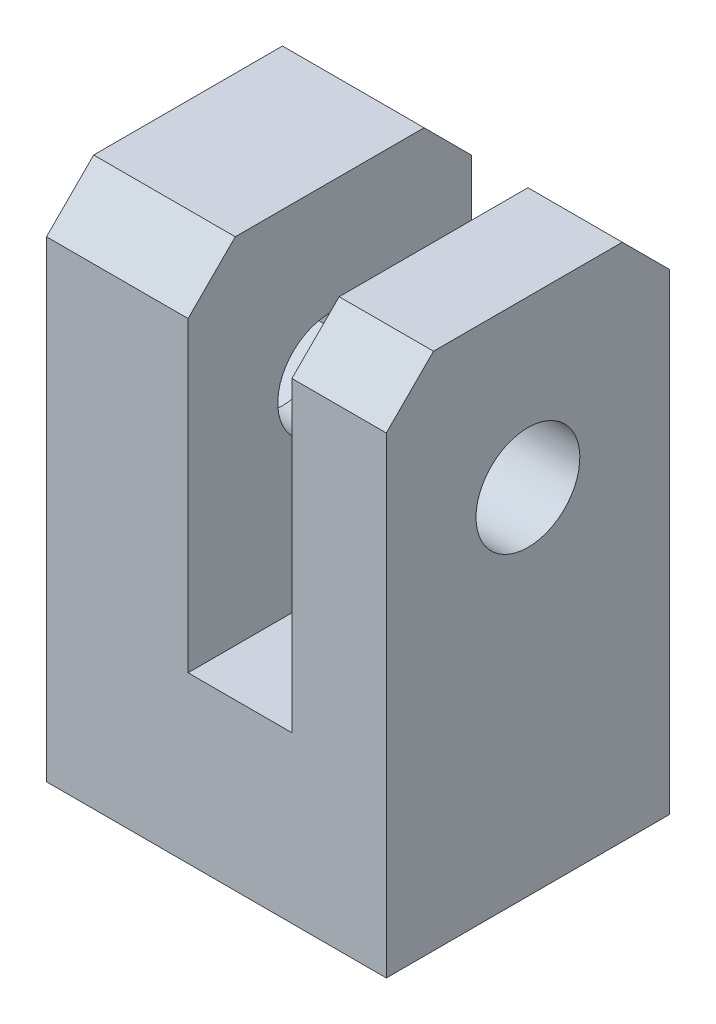
ISO-10303-21;
HEADER;
FILE_DESCRIPTION(('STEP AP214'),'2;1');
FILE_NAME('part.step','',(''),(''),'','','');
FILE_SCHEMA(('AUTOMOTIVE_DESIGN { 1 0 10303 214 1 1 1 1 }'));
ENDSEC;
DATA;
#1=APPLICATION_CONTEXT('core data for automotive mechanical design processes');
#2=APPLICATION_PROTOCOL_DEFINITION('international standard','automotive_design',2000,#1);
#3=PRODUCT_CONTEXT('',#1,'mechanical');
#4=PRODUCT('Part','Part','',(#3));
#5=PRODUCT_RELATED_PRODUCT_CATEGORY('part','',(#4));
#6=PRODUCT_DEFINITION_FORMATION('','',#4);
#7=PRODUCT_DEFINITION_CONTEXT('part definition',#1,'design');
#8=PRODUCT_DEFINITION('design','',#6,#7);
#9=PRODUCT_DEFINITION_SHAPE('','',#8);
#10=(LENGTH_UNIT() NAMED_UNIT(*) SI_UNIT(.MILLI.,.METRE.));
#11=(NAMED_UNIT(*) PLANE_ANGLE_UNIT() SI_UNIT($,.RADIAN.));
#12=(NAMED_UNIT(*) SI_UNIT($,.STERADIAN.) SOLID_ANGLE_UNIT());
#13=UNCERTAINTY_MEASURE_WITH_UNIT(LENGTH_MEASURE(1.E-05),#10,'distance_accuracy_value','');
#14=(GEOMETRIC_REPRESENTATION_CONTEXT(3) GLOBAL_UNCERTAINTY_ASSIGNED_CONTEXT((#13)) GLOBAL_UNIT_ASSIGNED_CONTEXT((#10,
#11,#12)) REPRESENTATION_CONTEXT('',''));
#15=CARTESIAN_POINT('',(0.,0.,0.));
#16=DIRECTION('',(0.,0.,1.));
#17=DIRECTION('',(1.,0.,0.));
#18=AXIS2_PLACEMENT_3D('',#15,#16,#17);
#19=CARTESIAN_POINT('',(1.1,7.5,6.));
#20=DIRECTION('',(0.,-1.,0.));
#21=DIRECTION('',(0.,0.,-1.));
#22=AXIS2_PLACEMENT_3D('',#19,#20,#21);
#23=PLANE('',#22);
#24=DIRECTION('',(0.,0.,-1.));
#25=VECTOR('',#24,1.);
#26=CARTESIAN_POINT('',(3.1,7.5,6.));
#27=LINE('',#26,#25);
#28=CARTESIAN_POINT('',(3.1,7.5,5.));
#29=VERTEX_POINT('',#28);
#30=CARTESIAN_POINT('',(3.1,7.5,0.999999999999999));
#31=VERTEX_POINT('',#30);
#32=EDGE_CURVE('E254',#29,#31,#27,.T.);
#33=ORIENTED_EDGE('',*,*,#32,.T.);
#34=DIRECTION('',(-1.,0.,0.));
#35=VECTOR('',#34,1.);
#36=CARTESIAN_POINT('',(1.1,7.5,0.999999999999999));
#37=LINE('',#36,#35);
#38=CARTESIAN_POINT('',(1.1,7.5,0.999999999999999));
#39=VERTEX_POINT('',#38);
#40=EDGE_CURVE('E301',#31,#39,#37,.T.);
#41=ORIENTED_EDGE('',*,*,#40,.T.);
#42=DIRECTION('',(0.,0.,-1.));
#43=VECTOR('',#42,1.);
#44=CARTESIAN_POINT('',(1.1,7.5,6.));
#45=LINE('',#44,#43);
#46=CARTESIAN_POINT('',(1.1,7.5,5.));
#47=VERTEX_POINT('',#46);
#48=EDGE_CURVE('E279',#47,#39,#45,.T.);
#49=ORIENTED_EDGE('',*,*,#48,.F.);
#50=DIRECTION('',(1.,0.,0.));
#51=VECTOR('',#50,1.);
#52=CARTESIAN_POINT('',(3.1,7.5,5.));
#53=LINE('',#52,#51);
#54=EDGE_CURVE('E299',#47,#29,#53,.T.);
#55=ORIENTED_EDGE('',*,*,#54,.T.);
#56=EDGE_LOOP('',(#33,#41,#49,#55));
#57=FACE_BOUND('',#56,.T.);
#58=ADVANCED_FACE('F32',(#57),#23,.F.);
#59=CARTESIAN_POINT('',(1.1,0.,6.));
#60=DIRECTION('',(1.,0.,0.));
#61=DIRECTION('',(0.,1.,0.));
#62=AXIS2_PLACEMENT_3D('',#59,#60,#61);
#63=PLANE('',#62);
#64=CARTESIAN_POINT('',(1.1,4.,3.));
#65=DIRECTION('',(-1.,0.,0.));
#66=DIRECTION('',(0.,-1.,0.));
#67=AXIS2_PLACEMENT_3D('',#64,#65,#66);
#68=CIRCLE('',#67,1.1);
#69=CARTESIAN_POINT('',(1.1,2.9,3.));
#70=VERTEX_POINT('',#69);
#71=EDGE_CURVE('E235',#70,#70,#68,.T.);
#72=ORIENTED_EDGE('',*,*,#71,.F.);
#73=EDGE_LOOP('',(#72));
#74=FACE_BOUND('',#73,.T.);
#75=ORIENTED_EDGE('',*,*,#48,.T.);
#76=DIRECTION('',(0.,0.707106781186549,0.707106781186546));
#77=VECTOR('',#76,1.);
#78=CARTESIAN_POINT('',(1.1,7.5,0.999999999999999));
#79=LINE('',#78,#77);
#80=CARTESIAN_POINT('',(1.1,6.5,0.));
#81=VERTEX_POINT('',#80);
#82=EDGE_CURVE('E305',#39,#81,#79,.F.);
#83=ORIENTED_EDGE('',*,*,#82,.T.);
#84=DIRECTION('',(0.,-1.,0.));
#85=VECTOR('',#84,1.);
#86=CARTESIAN_POINT('',(1.1,0.,0.));
#87=LINE('',#86,#85);
#88=CARTESIAN_POINT('',(1.1,0.,0.));
#89=VERTEX_POINT('',#88);
#90=EDGE_CURVE('E241',#81,#89,#87,.T.);
#91=ORIENTED_EDGE('',*,*,#90,.T.);
#92=DIRECTION('',(0.,0.,-1.));
#93=VECTOR('',#92,1.);
#94=CARTESIAN_POINT('',(1.1,0.,6.));
#95=LINE('',#94,#93);
#96=CARTESIAN_POINT('',(1.1,0.,6.));
#97=VERTEX_POINT('',#96);
#98=EDGE_CURVE('E276',#97,#89,#95,.T.);
#99=ORIENTED_EDGE('',*,*,#98,.F.);
#100=DIRECTION('',(0.,-1.,0.));
#101=VECTOR('',#100,1.);
#102=CARTESIAN_POINT('',(1.1,0.,6.));
#103=LINE('',#102,#101);
#104=CARTESIAN_POINT('',(1.1,6.5,6.));
#105=VERTEX_POINT('',#104);
#106=EDGE_CURVE('E242',#105,#97,#103,.T.);
#107=ORIENTED_EDGE('',*,*,#106,.F.);
#108=DIRECTION('',(0.,0.707106781186546,-0.707106781186549));
#109=VECTOR('',#108,1.);
#110=CARTESIAN_POINT('',(1.1,6.5,6.));
#111=LINE('',#110,#109);
#112=EDGE_CURVE('E55',#105,#47,#111,.T.);
#113=ORIENTED_EDGE('',*,*,#112,.T.);
#114=EDGE_LOOP('',(#75,#83,#91,#99,#107,#113));
#115=FACE_BOUND('',#114,.T.);
#116=ADVANCED_FACE('F337',(#74,#115),#63,.F.);
#117=CARTESIAN_POINT('',(-1.1,0.,6.));
#118=DIRECTION('',(0.,-1.,0.));
#119=DIRECTION('',(1.,0.,0.));
#120=AXIS2_PLACEMENT_3D('',#117,#118,#119);
#121=PLANE('',#120);
#122=CARTESIAN_POINT('',(0.,0.,3.));
#123=DIRECTION('',(0.,-1.,0.));
#124=DIRECTION('',(1.,0.,0.));
#125=AXIS2_PLACEMENT_3D('',#122,#123,#124);
#126=CIRCLE('',#125,0.95);
#127=CARTESIAN_POINT('',(0.950000000000001,0.,3.));
#128=VERTEX_POINT('',#127);
#129=EDGE_CURVE('E198',#128,#128,#126,.F.);
#130=ORIENTED_EDGE('',*,*,#129,.F.);
#131=EDGE_LOOP('',(#130));
#132=FACE_BOUND('',#131,.T.);
#133=DIRECTION('',(-1.,0.,0.));
#134=VECTOR('',#133,1.);
#135=CARTESIAN_POINT('',(-1.1,0.,0.));
#136=LINE('',#135,#134);
#137=CARTESIAN_POINT('',(-1.1,0.,0.));
#138=VERTEX_POINT('',#137);
#139=EDGE_CURVE('E256',#89,#138,#136,.T.);
#140=ORIENTED_EDGE('',*,*,#139,.T.);
#141=DIRECTION('',(0.,0.,-1.));
#142=VECTOR('',#141,1.);
#143=CARTESIAN_POINT('',(-1.1,0.,6.));
#144=LINE('',#143,#142);
#145=CARTESIAN_POINT('',(-1.1,0.,6.));
#146=VERTEX_POINT('',#145);
#147=EDGE_CURVE('E273',#146,#138,#144,.T.);
#148=ORIENTED_EDGE('',*,*,#147,.F.);
#149=DIRECTION('',(-1.,0.,0.));
#150=VECTOR('',#149,1.);
#151=CARTESIAN_POINT('',(-1.1,0.,6.));
#152=LINE('',#151,#150);
#153=EDGE_CURVE('E244',#97,#146,#152,.T.);
#154=ORIENTED_EDGE('',*,*,#153,.F.);
#155=ORIENTED_EDGE('',*,*,#98,.T.);
#156=EDGE_LOOP('',(#140,#148,#154,#155));
#157=FACE_BOUND('',#156,.T.);
#158=ADVANCED_FACE('F343',(#132,#157),#121,.F.);
#159=CARTESIAN_POINT('',(-1.1,7.5,6.));
#160=DIRECTION('',(-1.,0.,0.));
#161=DIRECTION('',(0.,-1.,0.));
#162=AXIS2_PLACEMENT_3D('',#159,#160,#161);
#163=PLANE('',#162);
#164=CARTESIAN_POINT('',(-1.1,4.,3.));
#165=DIRECTION('',(1.,0.,0.));
#166=DIRECTION('',(0.,0.,-1.));
#167=AXIS2_PLACEMENT_3D('',#164,#165,#166);
#168=CIRCLE('',#167,1.1);
#169=CARTESIAN_POINT('',(-1.1,4.,1.9));
#170=VERTEX_POINT('',#169);
#171=EDGE_CURVE('E229',#170,#170,#168,.T.);
#172=ORIENTED_EDGE('',*,*,#171,.F.);
#173=EDGE_LOOP('',(#172));
#174=FACE_BOUND('',#173,.T.);
#175=DIRECTION('',(0.,1.,0.));
#176=VECTOR('',#175,1.);
#177=CARTESIAN_POINT('',(-1.1,7.5,0.));
#178=LINE('',#177,#176);
#179=CARTESIAN_POINT('',(-1.1,6.5,0.));
#180=VERTEX_POINT('',#179);
#181=EDGE_CURVE('E258',#138,#180,#178,.T.);
#182=ORIENTED_EDGE('',*,*,#181,.T.);
#183=DIRECTION('',(0.,-0.707106781186549,-0.707106781186546));
#184=VECTOR('',#183,1.);
#185=CARTESIAN_POINT('',(-1.1,7.5,0.999999999999999));
#186=LINE('',#185,#184);
#187=CARTESIAN_POINT('',(-1.1,7.5,0.999999999999999));
#188=VERTEX_POINT('',#187);
#189=EDGE_CURVE('E297',#180,#188,#186,.F.);
#190=ORIENTED_EDGE('',*,*,#189,.T.);
#191=DIRECTION('',(0.,0.,-1.));
#192=VECTOR('',#191,1.);
#193=CARTESIAN_POINT('',(-1.1,7.5,6.));
#194=LINE('',#193,#192);
#195=CARTESIAN_POINT('',(-1.1,7.5,5.));
#196=VERTEX_POINT('',#195);
#197=EDGE_CURVE('E270',#196,#188,#194,.T.);
#198=ORIENTED_EDGE('',*,*,#197,.F.);
#199=DIRECTION('',(0.,-0.707106781186546,0.707106781186549));
#200=VECTOR('',#199,1.);
#201=CARTESIAN_POINT('',(-1.1,6.5,6.));
#202=LINE('',#201,#200);
#203=CARTESIAN_POINT('',(-1.1,6.5,6.));
#204=VERTEX_POINT('',#203);
#205=EDGE_CURVE('E295',#196,#204,#202,.T.);
#206=ORIENTED_EDGE('',*,*,#205,.T.);
#207=DIRECTION('',(0.,1.,0.));
#208=VECTOR('',#207,1.);
#209=CARTESIAN_POINT('',(-1.1,7.5,6.));
#210=LINE('',#209,#208);
#211=EDGE_CURVE('E247',#146,#204,#210,.T.);
#212=ORIENTED_EDGE('',*,*,#211,.F.);
#213=ORIENTED_EDGE('',*,*,#147,.T.);
#214=EDGE_LOOP('',(#182,#190,#198,#206,#212,#213));
#215=FACE_BOUND('',#214,.T.);
#216=ADVANCED_FACE('F347',(#174,#215),#163,.F.);
#217=CARTESIAN_POINT('',(-2.1,7.5,6.));
#218=DIRECTION('',(0.,-1.,0.));
#219=DIRECTION('',(0.,0.,-1.));
#220=AXIS2_PLACEMENT_3D('',#217,#218,#219);
#221=PLANE('',#220);
#222=ORIENTED_EDGE('',*,*,#197,.T.);
#223=DIRECTION('',(-1.,0.,0.));
#224=VECTOR('',#223,1.);
#225=CARTESIAN_POINT('',(-2.1,7.5,0.999999999999999));
#226=LINE('',#225,#224);
#227=CARTESIAN_POINT('',(-4.1,7.5,0.999999999999999));
#228=VERTEX_POINT('',#227);
#229=EDGE_CURVE('E284',#188,#228,#226,.T.);
#230=ORIENTED_EDGE('',*,*,#229,.T.);
#231=DIRECTION('',(0.,0.,-1.));
#232=VECTOR('',#231,1.);
#233=CARTESIAN_POINT('',(-4.1,7.5,6.));
#234=LINE('',#233,#232);
#235=CARTESIAN_POINT('',(-4.1,7.5,5.));
#236=VERTEX_POINT('',#235);
#237=EDGE_CURVE('E178',#236,#228,#234,.T.);
#238=ORIENTED_EDGE('',*,*,#237,.F.);
#239=DIRECTION('',(1.,0.,0.));
#240=VECTOR('',#239,1.);
#241=CARTESIAN_POINT('',(-1.1,7.5,5.));
#242=LINE('',#241,#240);
#243=EDGE_CURVE('E282',#236,#196,#242,.T.);
#244=ORIENTED_EDGE('',*,*,#243,.T.);
#245=EDGE_LOOP('',(#222,#230,#238,#244));
#246=FACE_BOUND('',#245,.T.);
#247=ADVANCED_FACE('F351',(#246),#221,.F.);
#248=CARTESIAN_POINT('',(-2.1,-3.5,6.));
#249=DIRECTION('',(1.,0.,0.));
#250=DIRECTION('',(0.,0.,-1.));
#251=AXIS2_PLACEMENT_3D('',#248,#249,#250);
#252=PLANE('',#251);
#253=DIRECTION('',(0.,-0.5,0.866025403784438));
#254=VECTOR('',#253,1.);
#255=CARTESIAN_POINT('',(-2.1,2.84529946162075,0.999999999999998));
#256=LINE('',#255,#254);
#257=CARTESIAN_POINT('',(-2.1,2.84529946162075,0.999999999999998));
#258=VERTEX_POINT('',#257);
#259=CARTESIAN_POINT('',(-2.1,1.69059892324149,3.));
#260=VERTEX_POINT('',#259);
#261=EDGE_CURVE('E171',#258,#260,#256,.T.);
#262=ORIENTED_EDGE('',*,*,#261,.T.);
#263=DIRECTION('',(0.,0.5,0.866025403784438));
#264=VECTOR('',#263,1.);
#265=CARTESIAN_POINT('',(-2.1,1.69059892324149,3.));
#266=LINE('',#265,#264);
#267=CARTESIAN_POINT('',(-2.1,2.84529946162075,5.));
#268=VERTEX_POINT('',#267);
#269=EDGE_CURVE('E196',#260,#268,#266,.T.);
#270=ORIENTED_EDGE('',*,*,#269,.T.);
#271=DIRECTION('',(0.,1.,0.));
#272=VECTOR('',#271,1.);
#273=CARTESIAN_POINT('',(-2.1,2.84529946162075,5.));
#274=LINE('',#273,#272);
#275=CARTESIAN_POINT('',(-2.1,5.15470053837925,5.));
#276=VERTEX_POINT('',#275);
#277=EDGE_CURVE('E177',#268,#276,#274,.T.);
#278=ORIENTED_EDGE('',*,*,#277,.T.);
#279=DIRECTION('',(0.,0.5,-0.866025403784439));
#280=VECTOR('',#279,1.);
#281=CARTESIAN_POINT('',(-2.1,5.15470053837925,5.));
#282=LINE('',#281,#280);
#283=CARTESIAN_POINT('',(-2.1,6.3094010767585,3.));
#284=VERTEX_POINT('',#283);
#285=EDGE_CURVE('E200',#276,#284,#282,.T.);
#286=ORIENTED_EDGE('',*,*,#285,.T.);
#287=DIRECTION('',(0.,-0.5,-0.866025403784438));
#288=VECTOR('',#287,1.);
#289=CARTESIAN_POINT('',(-2.1,6.3094010767585,3.));
#290=LINE('',#289,#288);
#291=CARTESIAN_POINT('',(-2.1,5.15470053837925,0.999999999999999));
#292=VERTEX_POINT('',#291);
#293=EDGE_CURVE('E203',#284,#292,#290,.T.);
#294=ORIENTED_EDGE('',*,*,#293,.T.);
#295=DIRECTION('',(0.,-1.,0.));
#296=VECTOR('',#295,1.);
#297=CARTESIAN_POINT('',(-2.1,5.15470053837925,0.999999999999999));
#298=LINE('',#297,#296);
#299=EDGE_CURVE('E206',#292,#258,#298,.T.);
#300=ORIENTED_EDGE('',*,*,#299,.T.);
#301=EDGE_LOOP('',(#262,#270,#278,#286,#294,#300));
#302=FACE_BOUND('',#301,.T.);
#303=CARTESIAN_POINT('',(-2.1,4.,3.));
#304=DIRECTION('',(1.,0.,0.));
#305=DIRECTION('',(0.,0.,-1.));
#306=AXIS2_PLACEMENT_3D('',#303,#304,#305);
#307=CIRCLE('',#306,1.1);
#308=CARTESIAN_POINT('',(-2.1,4.,1.9));
#309=VERTEX_POINT('',#308);
#310=EDGE_CURVE('E232',#309,#309,#307,.F.);
#311=ORIENTED_EDGE('',*,*,#310,.F.);
#312=EDGE_LOOP('',(#311));
#313=FACE_BOUND('',#312,.T.);
#314=ADVANCED_FACE('F386',(#302,#313),#252,.F.);
#315=CARTESIAN_POINT('',(-2.1,-3.5,6.));
#316=DIRECTION('',(0.,1.,0.));
#317=DIRECTION('',(0.,0.,1.));
#318=AXIS2_PLACEMENT_3D('',#315,#316,#317);
#319=PLANE('',#318);
#320=CARTESIAN_POINT('',(0.,-3.5,3.));
#321=DIRECTION('',(0.,-1.,0.));
#322=DIRECTION('',(1.,0.,0.));
#323=AXIS2_PLACEMENT_3D('',#320,#321,#322);
#324=CIRCLE('',#323,0.95);
#325=CARTESIAN_POINT('',(0.95,-3.5,3.));
#326=VERTEX_POINT('',#325);
#327=EDGE_CURVE('E598',#326,#326,#324,.T.);
#328=ORIENTED_EDGE('',*,*,#327,.F.);
#329=EDGE_LOOP('',(#328));
#330=FACE_BOUND('',#329,.T.);
#331=DIRECTION('',(1.,0.,0.));
#332=VECTOR('',#331,1.);
#333=CARTESIAN_POINT('',(-2.1,-3.5,0.));
#334=LINE('',#333,#332);
#335=CARTESIAN_POINT('',(-4.1,-3.5,0.));
#336=VERTEX_POINT('',#335);
#337=CARTESIAN_POINT('',(3.1,-3.5,0.));
#338=VERTEX_POINT('',#337);
#339=EDGE_CURVE('E261',#336,#338,#334,.T.);
#340=ORIENTED_EDGE('',*,*,#339,.T.);
#341=DIRECTION('',(0.,0.,-1.));
#342=VECTOR('',#341,1.);
#343=CARTESIAN_POINT('',(3.1,-3.5,6.));
#344=LINE('',#343,#342);
#345=CARTESIAN_POINT('',(3.1,-3.5,6.));
#346=VERTEX_POINT('',#345);
#347=EDGE_CURVE('E267',#346,#338,#344,.T.);
#348=ORIENTED_EDGE('',*,*,#347,.F.);
#349=DIRECTION('',(1.,0.,0.));
#350=VECTOR('',#349,1.);
#351=CARTESIAN_POINT('',(-2.1,-3.5,6.));
#352=LINE('',#351,#350);
#353=CARTESIAN_POINT('',(-4.1,-3.5,6.));
#354=VERTEX_POINT('',#353);
#355=EDGE_CURVE('E250',#354,#346,#352,.T.);
#356=ORIENTED_EDGE('',*,*,#355,.F.);
#357=DIRECTION('',(0.,0.,1.));
#358=VECTOR('',#357,1.);
#359=CARTESIAN_POINT('',(-4.1,-3.5,0.));
#360=LINE('',#359,#358);
#361=EDGE_CURVE('E223',#336,#354,#360,.T.);
#362=ORIENTED_EDGE('',*,*,#361,.F.);
#363=EDGE_LOOP('',(#340,#348,#356,#362));
#364=FACE_BOUND('',#363,.T.);
#365=ADVANCED_FACE('F323',(#330,#364),#319,.F.);
#366=CARTESIAN_POINT('',(3.1,-3.5,6.));
#367=DIRECTION('',(-1.,0.,0.));
#368=DIRECTION('',(0.,0.,1.));
#369=AXIS2_PLACEMENT_3D('',#366,#367,#368);
#370=PLANE('',#369);
#371=CARTESIAN_POINT('',(3.1,4.,3.));
#372=DIRECTION('',(-1.,0.,0.));
#373=DIRECTION('',(0.,0.,1.));
#374=AXIS2_PLACEMENT_3D('',#371,#372,#373);
#375=CIRCLE('',#374,1.1);
#376=CARTESIAN_POINT('',(3.1,4.,4.1));
#377=VERTEX_POINT('',#376);
#378=EDGE_CURVE('E238',#377,#377,#375,.F.);
#379=ORIENTED_EDGE('',*,*,#378,.F.);
#380=EDGE_LOOP('',(#379));
#381=FACE_BOUND('',#380,.T.);
#382=DIRECTION('',(0.,1.,0.));
#383=VECTOR('',#382,1.);
#384=CARTESIAN_POINT('',(3.1,-3.5,0.));
#385=LINE('',#384,#383);
#386=CARTESIAN_POINT('',(3.1,6.5,0.));
#387=VERTEX_POINT('',#386);
#388=EDGE_CURVE('E245',#338,#387,#385,.T.);
#389=ORIENTED_EDGE('',*,*,#388,.T.);
#390=DIRECTION('',(0.,-0.707106781186549,-0.707106781186546));
#391=VECTOR('',#390,1.);
#392=CARTESIAN_POINT('',(3.1,7.5,0.999999999999999));
#393=LINE('',#392,#391);
#394=EDGE_CURVE('E308',#387,#31,#393,.F.);
#395=ORIENTED_EDGE('',*,*,#394,.T.);
#396=ORIENTED_EDGE('',*,*,#32,.F.);
#397=DIRECTION('',(0.,-0.707106781186546,0.707106781186549));
#398=VECTOR('',#397,1.);
#399=CARTESIAN_POINT('',(3.1,6.5,6.));
#400=LINE('',#399,#398);
#401=CARTESIAN_POINT('',(3.1,6.5,6.));
#402=VERTEX_POINT('',#401);
#403=EDGE_CURVE('E47',#29,#402,#400,.T.);
#404=ORIENTED_EDGE('',*,*,#403,.T.);
#405=DIRECTION('',(0.,1.,0.));
#406=VECTOR('',#405,1.);
#407=CARTESIAN_POINT('',(3.1,-3.5,6.));
#408=LINE('',#407,#406);
#409=EDGE_CURVE('E252',#346,#402,#408,.T.);
#410=ORIENTED_EDGE('',*,*,#409,.F.);
#411=ORIENTED_EDGE('',*,*,#347,.T.);
#412=EDGE_LOOP('',(#389,#395,#396,#404,#410,#411));
#413=FACE_BOUND('',#412,.T.);
#414=ADVANCED_FACE('F330',(#381,#413),#370,.F.);
#415=CARTESIAN_POINT('',(0.,0.,6.));
#416=DIRECTION('',(0.,0.,1.));
#417=DIRECTION('',(1.,0.,0.));
#418=AXIS2_PLACEMENT_3D('',#415,#416,#417);
#419=PLANE('',#418);
#420=ORIENTED_EDGE('',*,*,#409,.T.);
#421=DIRECTION('',(-1.,0.,0.));
#422=VECTOR('',#421,1.);
#423=CARTESIAN_POINT('',(1.1,6.5,6.));
#424=LINE('',#423,#422);
#425=EDGE_CURVE('E11',#402,#105,#424,.T.);
#426=ORIENTED_EDGE('',*,*,#425,.T.);
#427=ORIENTED_EDGE('',*,*,#106,.T.);
#428=ORIENTED_EDGE('',*,*,#153,.T.);
#429=ORIENTED_EDGE('',*,*,#211,.T.);
#430=DIRECTION('',(-1.,0.,0.));
#431=VECTOR('',#430,1.);
#432=CARTESIAN_POINT('',(-4.1,6.5,6.));
#433=LINE('',#432,#431);
#434=CARTESIAN_POINT('',(-4.1,6.5,6.));
#435=VERTEX_POINT('',#434);
#436=EDGE_CURVE('E40',#204,#435,#433,.T.);
#437=ORIENTED_EDGE('',*,*,#436,.T.);
#438=DIRECTION('',(0.,1.,0.));
#439=VECTOR('',#438,1.);
#440=CARTESIAN_POINT('',(-4.1,-3.5,6.));
#441=LINE('',#440,#439);
#442=EDGE_CURVE('E226',#354,#435,#441,.T.);
#443=ORIENTED_EDGE('',*,*,#442,.F.);
#444=ORIENTED_EDGE('',*,*,#355,.T.);
#445=EDGE_LOOP('',(#420,#426,#427,#428,#429,#437,#443,#444));
#446=FACE_BOUND('',#445,.T.);
#447=ADVANCED_FACE('F313',(#446),#419,.T.);
#448=CARTESIAN_POINT('',(0.,0.,0.));
#449=DIRECTION('',(0.,0.,1.));
#450=DIRECTION('',(1.,0.,0.));
#451=AXIS2_PLACEMENT_3D('',#448,#449,#450);
#452=PLANE('',#451);
#453=DIRECTION('',(0.,-1.,0.));
#454=VECTOR('',#453,1.);
#455=CARTESIAN_POINT('',(-4.1,7.5,0.));
#456=LINE('',#455,#454);
#457=CARTESIAN_POINT('',(-4.1,6.5,0.));
#458=VERTEX_POINT('',#457);
#459=EDGE_CURVE('E221',#458,#336,#456,.T.);
#460=ORIENTED_EDGE('',*,*,#459,.F.);
#461=DIRECTION('',(1.,0.,0.));
#462=VECTOR('',#461,1.);
#463=CARTESIAN_POINT('',(0.,6.5,0.));
#464=LINE('',#463,#462);
#465=EDGE_CURVE('E293',#458,#180,#464,.T.);
#466=ORIENTED_EDGE('',*,*,#465,.T.);
#467=ORIENTED_EDGE('',*,*,#181,.F.);
#468=ORIENTED_EDGE('',*,*,#139,.F.);
#469=ORIENTED_EDGE('',*,*,#90,.F.);
#470=DIRECTION('',(1.,0.,0.));
#471=VECTOR('',#470,1.);
#472=CARTESIAN_POINT('',(0.,6.5,0.));
#473=LINE('',#472,#471);
#474=EDGE_CURVE('E291',#81,#387,#473,.T.);
#475=ORIENTED_EDGE('',*,*,#474,.T.);
#476=ORIENTED_EDGE('',*,*,#388,.F.);
#477=ORIENTED_EDGE('',*,*,#339,.F.);
#478=EDGE_LOOP('',(#460,#466,#467,#468,#469,#475,#476,#477));
#479=FACE_BOUND('',#478,.T.);
#480=ADVANCED_FACE('F356',(#479),#452,.F.);
#481=CARTESIAN_POINT('',(3.101,4.,3.));
#482=DIRECTION('',(-1.,0.,0.));
#483=DIRECTION('',(0.,-1.,0.));
#484=AXIS2_PLACEMENT_3D('',#481,#482,#483);
#485=CYLINDRICAL_SURFACE('',#484,1.1);
#486=ORIENTED_EDGE('',*,*,#71,.T.);
#487=EDGE_LOOP('',(#486));
#488=FACE_BOUND('',#487,.T.);
#489=ORIENTED_EDGE('',*,*,#378,.T.);
#490=EDGE_LOOP('',(#489));
#491=FACE_BOUND('',#490,.T.);
#492=ADVANCED_FACE('F398',(#488,#491),#485,.F.);
#493=CARTESIAN_POINT('',(-2.101,4.,3.));
#494=DIRECTION('',(1.,0.,0.));
#495=DIRECTION('',(0.,0.,-1.));
#496=AXIS2_PLACEMENT_3D('',#493,#494,#495);
#497=CYLINDRICAL_SURFACE('',#496,1.1);
#498=ORIENTED_EDGE('',*,*,#171,.T.);
#499=EDGE_LOOP('',(#498));
#500=FACE_BOUND('',#499,.T.);
#501=ORIENTED_EDGE('',*,*,#310,.T.);
#502=EDGE_LOOP('',(#501));
#503=FACE_BOUND('',#502,.T.);
#504=ADVANCED_FACE('F403',(#500,#503),#497,.F.);
#505=CARTESIAN_POINT('',(-4.1,0.,0.));
#506=DIRECTION('',(-1.,0.,0.));
#507=DIRECTION('',(0.,0.,1.));
#508=AXIS2_PLACEMENT_3D('',#505,#506,#507);
#509=PLANE('',#508);
#510=ORIENTED_EDGE('',*,*,#237,.T.);
#511=DIRECTION('',(0.,0.707106781186549,0.707106781186546));
#512=VECTOR('',#511,1.);
#513=CARTESIAN_POINT('',(-4.1,3.24999999999998,-3.25));
#514=LINE('',#513,#512);
#515=EDGE_CURVE('E289',#228,#458,#514,.F.);
#516=ORIENTED_EDGE('',*,*,#515,.T.);
#517=ORIENTED_EDGE('',*,*,#459,.T.);
#518=ORIENTED_EDGE('',*,*,#361,.T.);
#519=ORIENTED_EDGE('',*,*,#442,.T.);
#520=DIRECTION('',(0.,0.707106781186546,-0.707106781186549));
#521=VECTOR('',#520,1.);
#522=CARTESIAN_POINT('',(-4.1,6.25000000000002,6.24999999999998));
#523=LINE('',#522,#521);
#524=EDGE_CURVE('E287',#435,#236,#523,.T.);
#525=ORIENTED_EDGE('',*,*,#524,.T.);
#526=EDGE_LOOP('',(#510,#516,#517,#518,#519,#525));
#527=FACE_BOUND('',#526,.T.);
#528=DIRECTION('',(0.,1.,0.));
#529=VECTOR('',#528,1.);
#530=CARTESIAN_POINT('',(-4.1,2.84529946162075,5.));
#531=LINE('',#530,#529);
#532=CARTESIAN_POINT('',(-4.1,2.84529946162075,5.));
#533=VERTEX_POINT('',#532);
#534=CARTESIAN_POINT('',(-4.1,5.15470053837925,5.));
#535=VERTEX_POINT('',#534);
#536=EDGE_CURVE('E170',#533,#535,#531,.T.);
#537=ORIENTED_EDGE('',*,*,#536,.F.);
#538=DIRECTION('',(0.,0.5,0.866025403784438));
#539=VECTOR('',#538,1.);
#540=CARTESIAN_POINT('',(-4.1,1.69059892324149,3.));
#541=LINE('',#540,#539);
#542=CARTESIAN_POINT('',(-4.1,1.69059892324149,3.));
#543=VERTEX_POINT('',#542);
#544=EDGE_CURVE('E160',#543,#533,#541,.T.);
#545=ORIENTED_EDGE('',*,*,#544,.F.);
#546=DIRECTION('',(0.,-0.5,0.866025403784438));
#547=VECTOR('',#546,1.);
#548=CARTESIAN_POINT('',(-4.1,2.84529946162075,0.999999999999998));
#549=LINE('',#548,#547);
#550=CARTESIAN_POINT('',(-4.1,2.84529946162075,0.999999999999998));
#551=VERTEX_POINT('',#550);
#552=EDGE_CURVE('E194',#551,#543,#549,.T.);
#553=ORIENTED_EDGE('',*,*,#552,.F.);
#554=DIRECTION('',(0.,-1.,0.));
#555=VECTOR('',#554,1.);
#556=CARTESIAN_POINT('',(-4.1,5.15470053837925,0.999999999999999));
#557=LINE('',#556,#555);
#558=CARTESIAN_POINT('',(-4.1,5.15470053837925,0.999999999999999));
#559=VERTEX_POINT('',#558);
#560=EDGE_CURVE('E191',#559,#551,#557,.T.);
#561=ORIENTED_EDGE('',*,*,#560,.F.);
#562=DIRECTION('',(0.,-0.5,-0.866025403784438));
#563=VECTOR('',#562,1.);
#564=CARTESIAN_POINT('',(-4.1,6.3094010767585,3.));
#565=LINE('',#564,#563);
#566=CARTESIAN_POINT('',(-4.1,6.3094010767585,3.));
#567=VERTEX_POINT('',#566);
#568=EDGE_CURVE('E186',#567,#559,#565,.T.);
#569=ORIENTED_EDGE('',*,*,#568,.F.);
#570=DIRECTION('',(0.,0.5,-0.866025403784439));
#571=VECTOR('',#570,1.);
#572=CARTESIAN_POINT('',(-4.1,5.15470053837925,5.));
#573=LINE('',#572,#571);
#574=EDGE_CURVE('E184',#535,#567,#573,.T.);
#575=ORIENTED_EDGE('',*,*,#574,.F.);
#576=EDGE_LOOP('',(#537,#545,#553,#561,#569,#575));
#577=FACE_BOUND('',#576,.T.);
#578=ADVANCED_FACE('F182',(#527,#577),#509,.T.);
#579=CARTESIAN_POINT('',(-4.1,1.69059892324149,3.));
#580=DIRECTION('',(0.,0.866025403784438,-0.5));
#581=DIRECTION('',(0.,0.5,0.866025403784438));
#582=AXIS2_PLACEMENT_3D('',#579,#580,#581);
#583=PLANE('',#582);
#584=ORIENTED_EDGE('',*,*,#269,.F.);
#585=DIRECTION('',(1.,0.,0.));
#586=VECTOR('',#585,1.);
#587=CARTESIAN_POINT('',(-4.1,1.69059892324149,3.));
#588=LINE('',#587,#586);
#589=EDGE_CURVE('E166',#543,#260,#588,.T.);
#590=ORIENTED_EDGE('',*,*,#589,.F.);
#591=ORIENTED_EDGE('',*,*,#544,.T.);
#592=DIRECTION('',(1.,0.,0.));
#593=VECTOR('',#592,1.);
#594=CARTESIAN_POINT('',(-4.1,2.84529946162075,5.));
#595=LINE('',#594,#593);
#596=EDGE_CURVE('E164',#533,#268,#595,.T.);
#597=ORIENTED_EDGE('',*,*,#596,.T.);
#598=EDGE_LOOP('',(#584,#590,#591,#597));
#599=FACE_BOUND('',#598,.T.);
#600=ADVANCED_FACE('F163',(#599),#583,.T.);
#601=CARTESIAN_POINT('',(-4.1,2.84529946162075,5.));
#602=DIRECTION('',(0.,0.,-1.));
#603=DIRECTION('',(-1.,0.,0.));
#604=AXIS2_PLACEMENT_3D('',#601,#602,#603);
#605=PLANE('',#604);
#606=ORIENTED_EDGE('',*,*,#277,.F.);
#607=ORIENTED_EDGE('',*,*,#596,.F.);
#608=ORIENTED_EDGE('',*,*,#536,.T.);
#609=DIRECTION('',(1.,0.,0.));
#610=VECTOR('',#609,1.);
#611=CARTESIAN_POINT('',(-4.1,5.15470053837925,5.));
#612=LINE('',#611,#610);
#613=EDGE_CURVE('E179',#535,#276,#612,.T.);
#614=ORIENTED_EDGE('',*,*,#613,.T.);
#615=EDGE_LOOP('',(#606,#607,#608,#614));
#616=FACE_BOUND('',#615,.T.);
#617=ADVANCED_FACE('F174',(#616),#605,.T.);
#618=CARTESIAN_POINT('',(-4.1,5.15470053837925,5.));
#619=DIRECTION('',(0.,-0.866025403784439,-0.5));
#620=DIRECTION('',(0.,0.5,-0.866025403784439));
#621=AXIS2_PLACEMENT_3D('',#618,#619,#620);
#622=PLANE('',#621);
#623=ORIENTED_EDGE('',*,*,#285,.F.);
#624=ORIENTED_EDGE('',*,*,#613,.F.);
#625=ORIENTED_EDGE('',*,*,#574,.T.);
#626=DIRECTION('',(1.,0.,0.));
#627=VECTOR('',#626,1.);
#628=CARTESIAN_POINT('',(-4.1,6.3094010767585,3.));
#629=LINE('',#628,#627);
#630=EDGE_CURVE('E216',#567,#284,#629,.T.);
#631=ORIENTED_EDGE('',*,*,#630,.T.);
#632=EDGE_LOOP('',(#623,#624,#625,#631));
#633=FACE_BOUND('',#632,.T.);
#634=ADVANCED_FACE('F414',(#633),#622,.T.);
#635=CARTESIAN_POINT('',(-4.1,6.3094010767585,3.));
#636=DIRECTION('',(0.,-0.866025403784439,0.5));
#637=DIRECTION('',(0.,-0.5,-0.866025403784438));
#638=AXIS2_PLACEMENT_3D('',#635,#636,#637);
#639=PLANE('',#638);
#640=ORIENTED_EDGE('',*,*,#293,.F.);
#641=ORIENTED_EDGE('',*,*,#630,.F.);
#642=ORIENTED_EDGE('',*,*,#568,.T.);
#643=DIRECTION('',(1.,0.,0.));
#644=VECTOR('',#643,1.);
#645=CARTESIAN_POINT('',(-4.1,5.15470053837925,0.999999999999999));
#646=LINE('',#645,#644);
#647=EDGE_CURVE('E214',#559,#292,#646,.T.);
#648=ORIENTED_EDGE('',*,*,#647,.T.);
#649=EDGE_LOOP('',(#640,#641,#642,#648));
#650=FACE_BOUND('',#649,.T.);
#651=ADVANCED_FACE('F417',(#650),#639,.T.);
#652=CARTESIAN_POINT('',(-4.1,5.15470053837925,0.999999999999999));
#653=DIRECTION('',(0.,0.,1.));
#654=DIRECTION('',(0.,-1.,0.));
#655=AXIS2_PLACEMENT_3D('',#652,#653,#654);
#656=PLANE('',#655);
#657=ORIENTED_EDGE('',*,*,#299,.F.);
#658=ORIENTED_EDGE('',*,*,#647,.F.);
#659=ORIENTED_EDGE('',*,*,#560,.T.);
#660=DIRECTION('',(1.,0.,0.));
#661=VECTOR('',#660,1.);
#662=CARTESIAN_POINT('',(-4.1,2.84529946162075,0.999999999999998));
#663=LINE('',#662,#661);
#664=EDGE_CURVE('E212',#551,#258,#663,.T.);
#665=ORIENTED_EDGE('',*,*,#664,.T.);
#666=EDGE_LOOP('',(#657,#658,#659,#665));
#667=FACE_BOUND('',#666,.T.);
#668=ADVANCED_FACE('F421',(#667),#656,.T.);
#669=CARTESIAN_POINT('',(-4.1,2.84529946162075,0.999999999999998));
#670=DIRECTION('',(0.,0.866025403784438,0.5));
#671=DIRECTION('',(0.,-0.5,0.866025403784438));
#672=AXIS2_PLACEMENT_3D('',#669,#670,#671);
#673=PLANE('',#672);
#674=ORIENTED_EDGE('',*,*,#261,.F.);
#675=ORIENTED_EDGE('',*,*,#664,.F.);
#676=ORIENTED_EDGE('',*,*,#552,.T.);
#677=ORIENTED_EDGE('',*,*,#589,.T.);
#678=EDGE_LOOP('',(#674,#675,#676,#677));
#679=FACE_BOUND('',#678,.T.);
#680=ADVANCED_FACE('F367',(#679),#673,.T.);
#681=CARTESIAN_POINT('',(0.,7.501,3.));
#682=DIRECTION('',(0.,-1.,0.));
#683=DIRECTION('',(1.,0.,0.));
#684=AXIS2_PLACEMENT_3D('',#681,#682,#683);
#685=CYLINDRICAL_SURFACE('',#684,0.95);
#686=ORIENTED_EDGE('',*,*,#327,.T.);
#687=EDGE_LOOP('',(#686));
#688=FACE_BOUND('',#687,.T.);
#689=ORIENTED_EDGE('',*,*,#129,.T.);
#690=EDGE_LOOP('',(#689));
#691=FACE_BOUND('',#690,.T.);
#692=ADVANCED_FACE('F360',(#688,#691),#685,.F.);
#693=CARTESIAN_POINT('',(-2.1,7.5,0.999999999999999));
#694=DIRECTION('',(0.,-0.707106781186546,0.707106781186549));
#695=DIRECTION('',(-1.,0.,0.));
#696=AXIS2_PLACEMENT_3D('',#693,#694,#695);
#697=PLANE('',#696);
#698=ORIENTED_EDGE('',*,*,#189,.F.);
#699=ORIENTED_EDGE('',*,*,#465,.F.);
#700=ORIENTED_EDGE('',*,*,#515,.F.);
#701=ORIENTED_EDGE('',*,*,#229,.F.);
#702=EDGE_LOOP('',(#698,#699,#700,#701));
#703=FACE_BOUND('',#702,.T.);
#704=ADVANCED_FACE('F358',(#703),#697,.F.);
#705=CARTESIAN_POINT('',(1.1,7.5,0.999999999999999));
#706=DIRECTION('',(0.,-0.707106781186546,0.707106781186549));
#707=DIRECTION('',(-1.,0.,0.));
#708=AXIS2_PLACEMENT_3D('',#705,#706,#707);
#709=PLANE('',#708);
#710=ORIENTED_EDGE('',*,*,#394,.F.);
#711=ORIENTED_EDGE('',*,*,#474,.F.);
#712=ORIENTED_EDGE('',*,*,#82,.F.);
#713=ORIENTED_EDGE('',*,*,#40,.F.);
#714=EDGE_LOOP('',(#710,#711,#712,#713));
#715=FACE_BOUND('',#714,.T.);
#716=ADVANCED_FACE('F335',(#715),#709,.F.);
#717=CARTESIAN_POINT('',(0.,6.5,6.));
#718=DIRECTION('',(0.,0.707106781186549,0.707106781186546));
#719=DIRECTION('',(1.,0.,0.));
#720=AXIS2_PLACEMENT_3D('',#717,#718,#719);
#721=PLANE('',#720);
#722=ORIENTED_EDGE('',*,*,#403,.F.);
#723=ORIENTED_EDGE('',*,*,#54,.F.);
#724=ORIENTED_EDGE('',*,*,#112,.F.);
#725=ORIENTED_EDGE('',*,*,#425,.F.);
#726=EDGE_LOOP('',(#722,#723,#724,#725));
#727=FACE_BOUND('',#726,.T.);
#728=ADVANCED_FACE('F326',(#727),#721,.T.);
#729=CARTESIAN_POINT('',(0.,6.5,6.));
#730=DIRECTION('',(0.,0.707106781186549,0.707106781186546));
#731=DIRECTION('',(1.,0.,0.));
#732=AXIS2_PLACEMENT_3D('',#729,#730,#731);
#733=PLANE('',#732);
#734=ORIENTED_EDGE('',*,*,#205,.F.);
#735=ORIENTED_EDGE('',*,*,#243,.F.);
#736=ORIENTED_EDGE('',*,*,#524,.F.);
#737=ORIENTED_EDGE('',*,*,#436,.F.);
#738=EDGE_LOOP('',(#734,#735,#736,#737));
#739=FACE_BOUND('',#738,.T.);
#740=ADVANCED_FACE('F34',(#739),#733,.T.);
#741=CLOSED_SHELL('',(#58,#116,#158,#216,#247,#314,#365,#414,#447,#480,#492,#504,#578,#600,#617,
#634,#651,#668,#680,#692,#704,#716,#728,#740));
#742=MANIFOLD_SOLID_BREP('B2',#741);
#743=ADVANCED_BREP_SHAPE_REPRESENTATION('',(#18,#742),#14);
#744=SHAPE_DEFINITION_REPRESENTATION(#9,#743);
ENDSEC;
END-ISO-10303-21;
